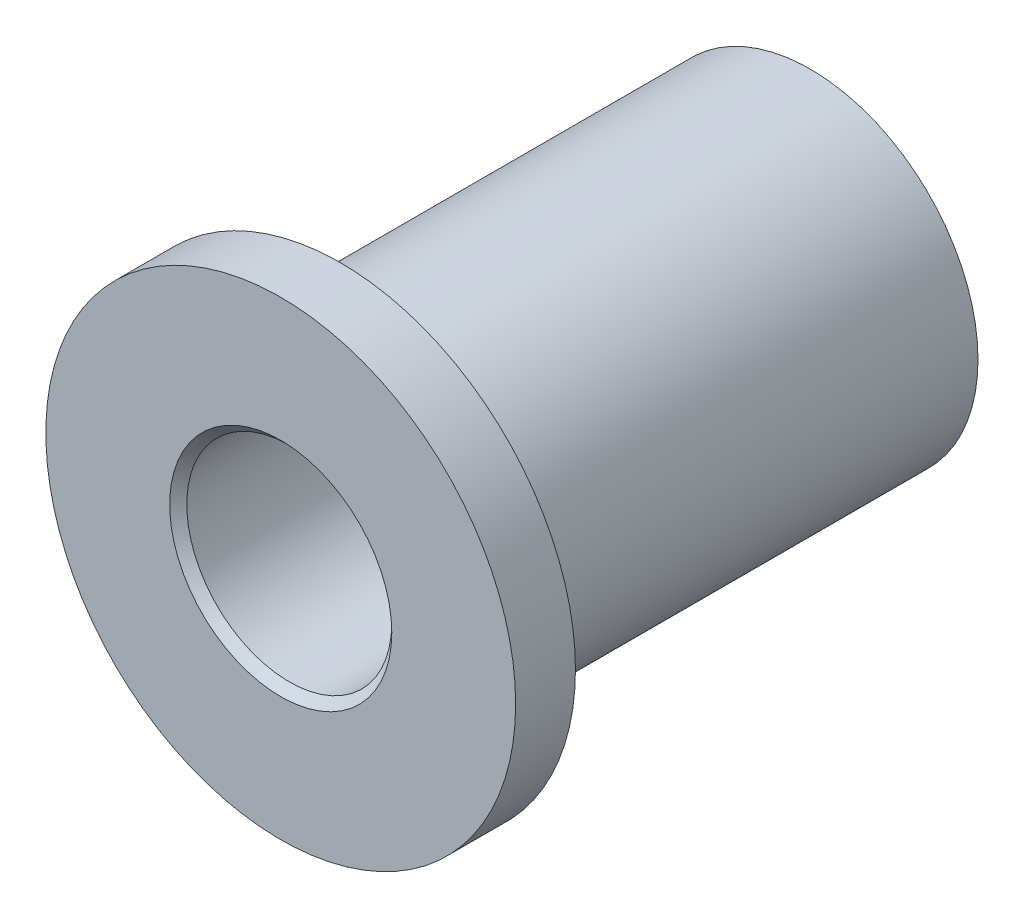
ISO-10303-21;
HEADER;
FILE_DESCRIPTION(('STEP AP214'),'2;1');
FILE_NAME('part.step','',(''),(''),'','','');
FILE_SCHEMA(('AUTOMOTIVE_DESIGN { 1 0 10303 214 1 1 1 1 }'));
ENDSEC;
DATA;
#1=APPLICATION_CONTEXT('core data for automotive mechanical design processes');
#2=APPLICATION_PROTOCOL_DEFINITION('international standard','automotive_design',2000,#1);
#3=PRODUCT_CONTEXT('',#1,'mechanical');
#4=PRODUCT('Part','Part','',(#3));
#5=PRODUCT_RELATED_PRODUCT_CATEGORY('part','',(#4));
#6=PRODUCT_DEFINITION_FORMATION('','',#4);
#7=PRODUCT_DEFINITION_CONTEXT('part definition',#1,'design');
#8=PRODUCT_DEFINITION('design','',#6,#7);
#9=PRODUCT_DEFINITION_SHAPE('','',#8);
#10=(LENGTH_UNIT() NAMED_UNIT(*) SI_UNIT(.MILLI.,.METRE.));
#11=(NAMED_UNIT(*) PLANE_ANGLE_UNIT() SI_UNIT($,.RADIAN.));
#12=(NAMED_UNIT(*) SI_UNIT($,.STERADIAN.) SOLID_ANGLE_UNIT());
#13=UNCERTAINTY_MEASURE_WITH_UNIT(LENGTH_MEASURE(1.E-05),#10,'distance_accuracy_value','');
#14=(GEOMETRIC_REPRESENTATION_CONTEXT(3) GLOBAL_UNCERTAINTY_ASSIGNED_CONTEXT((#13)) GLOBAL_UNIT_ASSIGNED_CONTEXT((#10,
#11,#12)) REPRESENTATION_CONTEXT('',''));
#15=CARTESIAN_POINT('',(0.,0.,0.));
#16=DIRECTION('',(0.,0.,1.));
#17=DIRECTION('',(1.,0.,0.));
#18=AXIS2_PLACEMENT_3D('',#15,#16,#17);
#19=CARTESIAN_POINT('',(0.,0.,-1.4));
#20=DIRECTION('',(0.,0.,1.));
#21=DIRECTION('',(1.,0.,0.));
#22=AXIS2_PLACEMENT_3D('',#19,#20,#21);
#23=PLANE('',#22);
#24=CARTESIAN_POINT('',(0.,0.,-1.4));
#25=DIRECTION('',(0.,0.,1.));
#26=DIRECTION('',(1.,0.,0.));
#27=AXIS2_PLACEMENT_3D('',#24,#25,#26);
#28=CIRCLE('',#27,5.5);
#29=CARTESIAN_POINT('',(5.5,0.,-1.4));
#30=VERTEX_POINT('',#29);
#31=EDGE_CURVE('E45',#30,#30,#28,.T.);
#32=ORIENTED_EDGE('',*,*,#31,.F.);
#33=EDGE_LOOP('',(#32));
#34=FACE_BOUND('',#33,.T.);
#35=CARTESIAN_POINT('',(0.,0.,-1.4));
#36=DIRECTION('',(0.,0.,1.));
#37=DIRECTION('',(1.,0.,0.));
#38=AXIS2_PLACEMENT_3D('',#35,#36,#37);
#39=CIRCLE('',#38,3.925);
#40=CARTESIAN_POINT('',(3.925,0.,-1.4));
#41=VERTEX_POINT('',#40);
#42=EDGE_CURVE('E41',#41,#41,#39,.F.);
#43=ORIENTED_EDGE('',*,*,#42,.F.);
#44=EDGE_LOOP('',(#43));
#45=FACE_BOUND('',#44,.T.);
#46=ADVANCED_FACE('F30',(#34,#45),#23,.F.);
#47=CARTESIAN_POINT('',(0.,0.,-1.4));
#48=DIRECTION('',(0.,0.,1.));
#49=DIRECTION('',(1.,0.,0.));
#50=AXIS2_PLACEMENT_3D('',#47,#48,#49);
#51=CYLINDRICAL_SURFACE('',#50,5.5);
#52=ORIENTED_EDGE('',*,*,#31,.T.);
#53=EDGE_LOOP('',(#52));
#54=FACE_BOUND('',#53,.T.);
#55=CARTESIAN_POINT('',(0.,0.,0.));
#56=DIRECTION('',(0.,0.,1.));
#57=DIRECTION('',(1.,0.,0.));
#58=AXIS2_PLACEMENT_3D('',#55,#56,#57);
#59=CIRCLE('',#58,5.5);
#60=CARTESIAN_POINT('',(5.5,0.,0.));
#61=VERTEX_POINT('',#60);
#62=EDGE_CURVE('E48',#61,#61,#59,.T.);
#63=ORIENTED_EDGE('',*,*,#62,.F.);
#64=EDGE_LOOP('',(#63));
#65=FACE_BOUND('',#64,.T.);
#66=ADVANCED_FACE('F74',(#54,#65),#51,.T.);
#67=CARTESIAN_POINT('',(0.,0.,0.));
#68=DIRECTION('',(0.,0.,1.));
#69=DIRECTION('',(1.,0.,0.));
#70=AXIS2_PLACEMENT_3D('',#67,#68,#69);
#71=PLANE('',#70);
#72=CARTESIAN_POINT('',(0.,0.,0.));
#73=DIRECTION('',(0.,0.,1.));
#74=DIRECTION('',(1.,0.,0.));
#75=AXIS2_PLACEMENT_3D('',#72,#73,#74);
#76=CIRCLE('',#75,2.60000000000001);
#77=CARTESIAN_POINT('',(2.60000000000001,0.,0.));
#78=VERTEX_POINT('',#77);
#79=EDGE_CURVE('E10',#78,#78,#76,.F.);
#80=ORIENTED_EDGE('',*,*,#79,.T.);
#81=EDGE_LOOP('',(#80));
#82=FACE_BOUND('',#81,.T.);
#83=ORIENTED_EDGE('',*,*,#62,.T.);
#84=EDGE_LOOP('',(#83));
#85=FACE_BOUND('',#84,.T.);
#86=ADVANCED_FACE('F80',(#82,#85),#71,.T.);
#87=CARTESIAN_POINT('',(0.,0.,-12.4));
#88=DIRECTION('',(0.,0.,1.));
#89=DIRECTION('',(1.,0.,0.));
#90=AXIS2_PLACEMENT_3D('',#87,#88,#89);
#91=CYLINDRICAL_SURFACE('',#90,3.925);
#92=CARTESIAN_POINT('',(0.,0.,-12.4));
#93=DIRECTION('',(0.,0.,-1.));
#94=DIRECTION('',(-1.,0.,0.));
#95=AXIS2_PLACEMENT_3D('',#92,#93,#94);
#96=CIRCLE('',#95,3.925);
#97=CARTESIAN_POINT('',(-3.925,0.,-12.4));
#98=VERTEX_POINT('',#97);
#99=EDGE_CURVE('E51',#98,#98,#96,.T.);
#100=ORIENTED_EDGE('',*,*,#99,.F.);
#101=EDGE_LOOP('',(#100));
#102=FACE_BOUND('',#101,.T.);
#103=ORIENTED_EDGE('',*,*,#42,.T.);
#104=EDGE_LOOP('',(#103));
#105=FACE_BOUND('',#104,.T.);
#106=ADVANCED_FACE('F71',(#102,#105),#91,.T.);
#107=CARTESIAN_POINT('',(0.,0.,-12.4));
#108=DIRECTION('',(0.,0.,-1.));
#109=DIRECTION('',(-1.,0.,0.));
#110=AXIS2_PLACEMENT_3D('',#107,#108,#109);
#111=PLANE('',#110);
#112=CARTESIAN_POINT('',(0.,0.,-12.4));
#113=DIRECTION('',(0.,0.,1.));
#114=DIRECTION('',(1.,0.,0.));
#115=AXIS2_PLACEMENT_3D('',#112,#113,#114);
#116=CIRCLE('',#115,2.4);
#117=CARTESIAN_POINT('',(2.4,0.,-12.4));
#118=VERTEX_POINT('',#117);
#119=EDGE_CURVE('E56',#118,#118,#116,.T.);
#120=ORIENTED_EDGE('',*,*,#119,.T.);
#121=EDGE_LOOP('',(#120));
#122=FACE_BOUND('',#121,.T.);
#123=ORIENTED_EDGE('',*,*,#99,.T.);
#124=EDGE_LOOP('',(#123));
#125=FACE_BOUND('',#124,.T.);
#126=ADVANCED_FACE('F60',(#122,#125),#111,.T.);
#127=CARTESIAN_POINT('',(0.,0.,-12.4));
#128=DIRECTION('',(0.,0.,1.));
#129=DIRECTION('',(1.,0.,0.));
#130=AXIS2_PLACEMENT_3D('',#127,#128,#129);
#131=CYLINDRICAL_SURFACE('',#130,2.4);
#132=CARTESIAN_POINT('',(0.,0.,-0.200000000000013));
#133=DIRECTION('',(0.,0.,1.));
#134=DIRECTION('',(1.,0.,0.));
#135=AXIS2_PLACEMENT_3D('',#132,#133,#134);
#136=CIRCLE('',#135,2.4);
#137=CARTESIAN_POINT('',(2.4,0.,-0.200000000000013));
#138=VERTEX_POINT('',#137);
#139=EDGE_CURVE('E37',#138,#138,#136,.T.);
#140=ORIENTED_EDGE('',*,*,#139,.T.);
#141=EDGE_LOOP('',(#140));
#142=FACE_BOUND('',#141,.T.);
#143=ORIENTED_EDGE('',*,*,#119,.F.);
#144=EDGE_LOOP('',(#143));
#145=FACE_BOUND('',#144,.T.);
#146=ADVANCED_FACE('F63',(#142,#145),#131,.F.);
#147=CARTESIAN_POINT('',(0.,0.,-0.200000000000013));
#148=DIRECTION('',(0.,0.,1.));
#149=DIRECTION('',(1.,0.,0.));
#150=AXIS2_PLACEMENT_3D('',#147,#148,#149);
#151=CONICAL_SURFACE('',#150,2.4,0.78539816339745);
#152=ORIENTED_EDGE('',*,*,#79,.F.);
#153=EDGE_LOOP('',(#152));
#154=FACE_BOUND('',#153,.T.);
#155=ORIENTED_EDGE('',*,*,#139,.F.);
#156=EDGE_LOOP('',(#155));
#157=FACE_BOUND('',#156,.T.);
#158=ADVANCED_FACE('F32',(#154,#157),#151,.F.);
#159=CLOSED_SHELL('',(#46,#66,#86,#106,#126,#146,#158));
#160=MANIFOLD_SOLID_BREP('B2',#159);
#161=ADVANCED_BREP_SHAPE_REPRESENTATION('',(#18,#160),#14);
#162=SHAPE_DEFINITION_REPRESENTATION(#9,#161);
ENDSEC;
END-ISO-10303-21;
